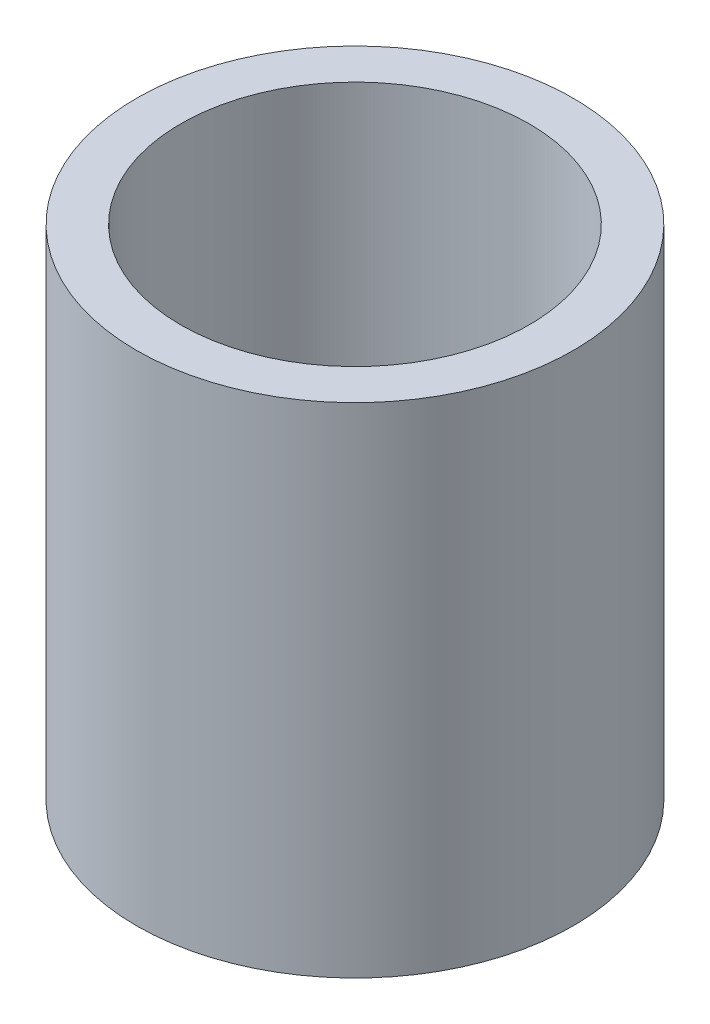
ISO-10303-21;
HEADER;
FILE_DESCRIPTION(('STEP AP214'),'2;1');
FILE_NAME('part.step','',(''),(''),'','','');
FILE_SCHEMA(('AUTOMOTIVE_DESIGN { 1 0 10303 214 1 1 1 1 }'));
ENDSEC;
DATA;
#1=APPLICATION_CONTEXT('core data for automotive mechanical design processes');
#2=APPLICATION_PROTOCOL_DEFINITION('international standard','automotive_design',2000,#1);
#3=PRODUCT_CONTEXT('',#1,'mechanical');
#4=PRODUCT('Part','Part','',(#3));
#5=PRODUCT_RELATED_PRODUCT_CATEGORY('part','',(#4));
#6=PRODUCT_DEFINITION_FORMATION('','',#4);
#7=PRODUCT_DEFINITION_CONTEXT('part definition',#1,'design');
#8=PRODUCT_DEFINITION('design','',#6,#7);
#9=PRODUCT_DEFINITION_SHAPE('','',#8);
#10=(LENGTH_UNIT() NAMED_UNIT(*) SI_UNIT(.MILLI.,.METRE.));
#11=(NAMED_UNIT(*) PLANE_ANGLE_UNIT() SI_UNIT($,.RADIAN.));
#12=(NAMED_UNIT(*) SI_UNIT($,.STERADIAN.) SOLID_ANGLE_UNIT());
#13=UNCERTAINTY_MEASURE_WITH_UNIT(LENGTH_MEASURE(1.E-05),#10,'distance_accuracy_value','');
#14=(GEOMETRIC_REPRESENTATION_CONTEXT(3) GLOBAL_UNCERTAINTY_ASSIGNED_CONTEXT((#13)) GLOBAL_UNIT_ASSIGNED_CONTEXT((#10,
#11,#12)) REPRESENTATION_CONTEXT('',''));
#15=CARTESIAN_POINT('',(0.,0.,0.));
#16=DIRECTION('',(0.,0.,1.));
#17=DIRECTION('',(1.,0.,0.));
#18=AXIS2_PLACEMENT_3D('',#15,#16,#17);
#19=CARTESIAN_POINT('',(0.,-19.05,0.));
#20=DIRECTION('',(0.,1.,0.));
#21=DIRECTION('',(0.,0.,1.));
#22=AXIS2_PLACEMENT_3D('',#19,#20,#21);
#23=CYLINDRICAL_SURFACE('',#22,13.3223);
#24=CARTESIAN_POINT('',(0.,19.05,0.));
#25=DIRECTION('',(0.,1.,0.));
#26=DIRECTION('',(0.,0.,1.));
#27=AXIS2_PLACEMENT_3D('',#24,#25,#26);
#28=CIRCLE('',#27,13.3223);
#29=CARTESIAN_POINT('',(0.,19.05,13.3223));
#30=VERTEX_POINT('',#29);
#31=EDGE_CURVE('E18',#30,#30,#28,.F.);
#32=ORIENTED_EDGE('',*,*,#31,.F.);
#33=EDGE_LOOP('',(#32));
#34=FACE_BOUND('',#33,.T.);
#35=CARTESIAN_POINT('',(0.,-19.05,0.));
#36=DIRECTION('',(0.,1.,0.));
#37=DIRECTION('',(0.,0.,1.));
#38=AXIS2_PLACEMENT_3D('',#35,#36,#37);
#39=CIRCLE('',#38,13.3223);
#40=CARTESIAN_POINT('',(0.,-19.05,13.3223));
#41=VERTEX_POINT('',#40);
#42=EDGE_CURVE('E27',#41,#41,#39,.F.);
#43=ORIENTED_EDGE('',*,*,#42,.T.);
#44=EDGE_LOOP('',(#43));
#45=FACE_BOUND('',#44,.T.);
#46=ADVANCED_FACE('F15',(#34,#45),#23,.F.);
#47=CARTESIAN_POINT('',(0.,19.05,0.));
#48=DIRECTION('',(0.,1.,0.));
#49=DIRECTION('',(0.,0.,1.));
#50=AXIS2_PLACEMENT_3D('',#47,#48,#49);
#51=PLANE('',#50);
#52=ORIENTED_EDGE('',*,*,#31,.T.);
#53=EDGE_LOOP('',(#52));
#54=FACE_BOUND('',#53,.T.);
#55=CARTESIAN_POINT('',(0.,19.05,0.));
#56=DIRECTION('',(0.,1.,0.));
#57=DIRECTION('',(0.,0.,1.));
#58=AXIS2_PLACEMENT_3D('',#55,#56,#57);
#59=CIRCLE('',#58,16.7005);
#60=CARTESIAN_POINT('',(0.,19.05,16.7005));
#61=VERTEX_POINT('',#60);
#62=EDGE_CURVE('E22',#61,#61,#59,.F.);
#63=ORIENTED_EDGE('',*,*,#62,.F.);
#64=EDGE_LOOP('',(#63));
#65=FACE_BOUND('',#64,.T.);
#66=ADVANCED_FACE('F35',(#54,#65),#51,.T.);
#67=CARTESIAN_POINT('',(0.,-19.05,0.));
#68=DIRECTION('',(0.,1.,0.));
#69=DIRECTION('',(0.,0.,1.));
#70=AXIS2_PLACEMENT_3D('',#67,#68,#69);
#71=PLANE('',#70);
#72=ORIENTED_EDGE('',*,*,#42,.F.);
#73=EDGE_LOOP('',(#72));
#74=FACE_BOUND('',#73,.T.);
#75=CARTESIAN_POINT('',(0.,-19.05,0.));
#76=DIRECTION('',(0.,1.,0.));
#77=DIRECTION('',(0.,0.,1.));
#78=AXIS2_PLACEMENT_3D('',#75,#76,#77);
#79=CIRCLE('',#78,16.7005);
#80=CARTESIAN_POINT('',(0.,-19.05,16.7005));
#81=VERTEX_POINT('',#80);
#82=EDGE_CURVE('E10',#81,#81,#79,.T.);
#83=ORIENTED_EDGE('',*,*,#82,.F.);
#84=EDGE_LOOP('',(#83));
#85=FACE_BOUND('',#84,.T.);
#86=ADVANCED_FACE('F43',(#74,#85),#71,.F.);
#87=CARTESIAN_POINT('',(0.,-19.05,0.));
#88=DIRECTION('',(0.,1.,0.));
#89=DIRECTION('',(0.,0.,1.));
#90=AXIS2_PLACEMENT_3D('',#87,#88,#89);
#91=CYLINDRICAL_SURFACE('',#90,16.7005);
#92=ORIENTED_EDGE('',*,*,#62,.T.);
#93=EDGE_LOOP('',(#92));
#94=FACE_BOUND('',#93,.T.);
#95=ORIENTED_EDGE('',*,*,#82,.T.);
#96=EDGE_LOOP('',(#95));
#97=FACE_BOUND('',#96,.T.);
#98=ADVANCED_FACE('F44',(#94,#97),#91,.T.);
#99=CLOSED_SHELL('',(#46,#66,#86,#98));
#100=MANIFOLD_SOLID_BREP('B1',#99);
#101=ADVANCED_BREP_SHAPE_REPRESENTATION('',(#18,#100),#14);
#102=SHAPE_DEFINITION_REPRESENTATION(#9,#101);
ENDSEC;
END-ISO-10303-21;
